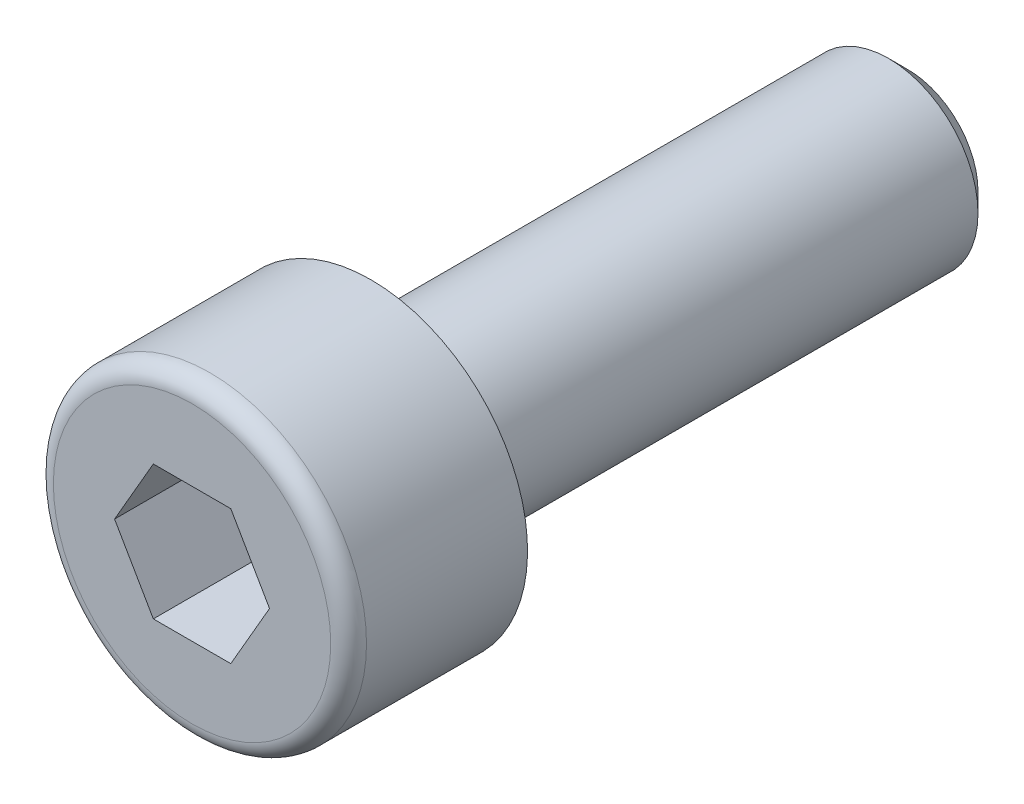
ISO-10303-21;
HEADER;
FILE_DESCRIPTION(('STEP AP214'),'2;1');
FILE_NAME('part.step','',(''),(''),'','','');
FILE_SCHEMA(('AUTOMOTIVE_DESIGN { 1 0 10303 214 1 1 1 1 }'));
ENDSEC;
DATA;
#1=APPLICATION_CONTEXT('core data for automotive mechanical design processes');
#2=APPLICATION_PROTOCOL_DEFINITION('international standard','automotive_design',2000,#1);
#3=PRODUCT_CONTEXT('',#1,'mechanical');
#4=PRODUCT('Part','Part','',(#3));
#5=PRODUCT_RELATED_PRODUCT_CATEGORY('part','',(#4));
#6=PRODUCT_DEFINITION_FORMATION('','',#4);
#7=PRODUCT_DEFINITION_CONTEXT('part definition',#1,'design');
#8=PRODUCT_DEFINITION('design','',#6,#7);
#9=PRODUCT_DEFINITION_SHAPE('','',#8);
#10=(LENGTH_UNIT() NAMED_UNIT(*) SI_UNIT(.MILLI.,.METRE.));
#11=(NAMED_UNIT(*) PLANE_ANGLE_UNIT() SI_UNIT($,.RADIAN.));
#12=(NAMED_UNIT(*) SI_UNIT($,.STERADIAN.) SOLID_ANGLE_UNIT());
#13=UNCERTAINTY_MEASURE_WITH_UNIT(LENGTH_MEASURE(1.E-05),#10,'distance_accuracy_value','');
#14=(GEOMETRIC_REPRESENTATION_CONTEXT(3) GLOBAL_UNCERTAINTY_ASSIGNED_CONTEXT((#13)) GLOBAL_UNIT_ASSIGNED_CONTEXT((#10,
#11,#12)) REPRESENTATION_CONTEXT('',''));
#15=CARTESIAN_POINT('',(0.,0.,0.));
#16=DIRECTION('',(0.,0.,1.));
#17=DIRECTION('',(1.,0.,0.));
#18=AXIS2_PLACEMENT_3D('',#15,#16,#17);
#19=CARTESIAN_POINT('',(0.,-1.5,2.50347876849692));
#20=DIRECTION('',(0.,1.,0.));
#21=DIRECTION('',(0.,0.,1.));
#22=AXIS2_PLACEMENT_3D('',#19,#20,#21);
#23=PLANE('',#22);
#24=DIRECTION('',(0.,0.,1.));
#25=VECTOR('',#24,1.);
#26=CARTESIAN_POINT('',(-0.866025403784438,-1.5,2.50347876849692));
#27=LINE('',#26,#25);
#28=CARTESIAN_POINT('',(-0.866025403784439,-1.5,4.));
#29=VERTEX_POINT('',#28);
#30=CARTESIAN_POINT('',(-0.866025403784439,-1.5,1.00695753699384));
#31=VERTEX_POINT('',#30);
#32=EDGE_CURVE('E73',#29,#31,#27,.F.);
#33=ORIENTED_EDGE('',*,*,#32,.F.);
#34=DIRECTION('',(1.,0.,0.));
#35=VECTOR('',#34,1.);
#36=CARTESIAN_POINT('',(0.,-1.5,4.));
#37=LINE('',#36,#35);
#38=CARTESIAN_POINT('',(0.866025403784439,-1.5,4.));
#39=VERTEX_POINT('',#38);
#40=EDGE_CURVE('E65',#29,#39,#37,.T.);
#41=ORIENTED_EDGE('',*,*,#40,.T.);
#42=DIRECTION('',(0.,0.,1.));
#43=VECTOR('',#42,1.);
#44=CARTESIAN_POINT('',(0.866025403784439,-1.5,2.50347876849692));
#45=LINE('',#44,#43);
#46=CARTESIAN_POINT('',(0.866025403784439,-1.5,1.00695753699384));
#47=VERTEX_POINT('',#46);
#48=EDGE_CURVE('E76',#47,#39,#45,.T.);
#49=ORIENTED_EDGE('',*,*,#48,.F.);
#50=DIRECTION('',(1.,0.,0.));
#51=VECTOR('',#50,1.);
#52=CARTESIAN_POINT('',(0.,-1.5,1.00695753699384));
#53=LINE('',#52,#51);
#54=EDGE_CURVE('E70',#47,#31,#53,.F.);
#55=ORIENTED_EDGE('',*,*,#54,.T.);
#56=EDGE_LOOP('',(#33,#41,#49,#55));
#57=FACE_BOUND('',#56,.T.);
#58=ADVANCED_FACE('F17',(#57),#23,.T.);
#59=CARTESIAN_POINT('',(-1.29903810567666,-0.750000000000001,2.50347876849692));
#60=DIRECTION('',(0.866025403784438,0.500000000000001,0.));
#61=DIRECTION('',(-0.500000000000001,0.866025403784438,0.));
#62=AXIS2_PLACEMENT_3D('',#59,#60,#61);
#63=PLANE('',#62);
#64=DIRECTION('',(0.,0.,1.));
#65=VECTOR('',#64,1.);
#66=CARTESIAN_POINT('',(-1.73205080756888,0.,2.50347876849692));
#67=LINE('',#66,#65);
#68=CARTESIAN_POINT('',(-1.73205080756888,0.,4.));
#69=VERTEX_POINT('',#68);
#70=CARTESIAN_POINT('',(-1.73205080756888,0.,1.00695753699384));
#71=VERTEX_POINT('',#70);
#72=EDGE_CURVE('E239',#69,#71,#67,.F.);
#73=ORIENTED_EDGE('',*,*,#72,.F.);
#74=DIRECTION('',(-0.500000000000001,0.866025403784438,0.));
#75=VECTOR('',#74,1.);
#76=CARTESIAN_POINT('',(-1.29903810567666,-0.750000000000001,4.));
#77=LINE('',#76,#75);
#78=EDGE_CURVE('E88',#69,#29,#77,.F.);
#79=ORIENTED_EDGE('',*,*,#78,.T.);
#80=ORIENTED_EDGE('',*,*,#32,.T.);
#81=DIRECTION('',(-0.500000000000001,0.866025403784438,0.));
#82=VECTOR('',#81,1.);
#83=CARTESIAN_POINT('',(-1.29903810567666,-0.750000000000001,1.00695753699384));
#84=LINE('',#83,#82);
#85=EDGE_CURVE('E81',#31,#71,#84,.T.);
#86=ORIENTED_EDGE('',*,*,#85,.T.);
#87=EDGE_LOOP('',(#73,#79,#80,#86));
#88=FACE_BOUND('',#87,.T.);
#89=ADVANCED_FACE('F90',(#88),#63,.T.);
#90=CARTESIAN_POINT('',(1.29903810567666,-0.749999999999999,2.50347876849692));
#91=DIRECTION('',(-0.866025403784439,0.5,0.));
#92=DIRECTION('',(-0.5,-0.866025403784439,0.));
#93=AXIS2_PLACEMENT_3D('',#90,#91,#92);
#94=PLANE('',#93);
#95=ORIENTED_EDGE('',*,*,#48,.T.);
#96=DIRECTION('',(-0.5,-0.866025403784439,0.));
#97=VECTOR('',#96,1.);
#98=CARTESIAN_POINT('',(1.29903810567666,-0.749999999999999,4.));
#99=LINE('',#98,#97);
#100=CARTESIAN_POINT('',(1.73205080756888,0.,4.));
#101=VERTEX_POINT('',#100);
#102=EDGE_CURVE('E241',#39,#101,#99,.F.);
#103=ORIENTED_EDGE('',*,*,#102,.T.);
#104=DIRECTION('',(0.,0.,1.));
#105=VECTOR('',#104,1.);
#106=CARTESIAN_POINT('',(1.73205080756888,0.,2.50347876849692));
#107=LINE('',#106,#105);
#108=CARTESIAN_POINT('',(1.73205080756888,0.,1.00695753699384));
#109=VERTEX_POINT('',#108);
#110=EDGE_CURVE('E229',#109,#101,#107,.T.);
#111=ORIENTED_EDGE('',*,*,#110,.F.);
#112=DIRECTION('',(-0.5,-0.866025403784439,0.));
#113=VECTOR('',#112,1.);
#114=CARTESIAN_POINT('',(1.73205080756888,0.,1.00695753699384));
#115=LINE('',#114,#113);
#116=EDGE_CURVE('E235',#109,#47,#115,.T.);
#117=ORIENTED_EDGE('',*,*,#116,.T.);
#118=EDGE_LOOP('',(#95,#103,#111,#117));
#119=FACE_BOUND('',#118,.T.);
#120=ADVANCED_FACE('F153',(#119),#94,.T.);
#121=CARTESIAN_POINT('',(-1.29903810567666,0.749999999999999,2.50347876849692));
#122=DIRECTION('',(0.866025403784439,-0.5,0.));
#123=DIRECTION('',(0.5,0.866025403784439,0.));
#124=AXIS2_PLACEMENT_3D('',#121,#122,#123);
#125=PLANE('',#124);
#126=DIRECTION('',(0.,0.,-1.));
#127=VECTOR('',#126,1.);
#128=CARTESIAN_POINT('',(-0.866025403784439,1.5,2.50347876849692));
#129=LINE('',#128,#127);
#130=CARTESIAN_POINT('',(-0.866025403784438,1.5,4.));
#131=VERTEX_POINT('',#130);
#132=CARTESIAN_POINT('',(-0.866025403784439,1.5,1.00695753699384));
#133=VERTEX_POINT('',#132);
#134=EDGE_CURVE('E224',#131,#133,#129,.T.);
#135=ORIENTED_EDGE('',*,*,#134,.F.);
#136=DIRECTION('',(0.5,0.866025403784439,0.));
#137=VECTOR('',#136,1.);
#138=CARTESIAN_POINT('',(-1.29903810567666,0.749999999999999,4.));
#139=LINE('',#138,#137);
#140=EDGE_CURVE('E35',#131,#69,#139,.F.);
#141=ORIENTED_EDGE('',*,*,#140,.T.);
#142=ORIENTED_EDGE('',*,*,#72,.T.);
#143=DIRECTION('',(0.499999999999999,0.866025403784439,0.));
#144=VECTOR('',#143,1.);
#145=CARTESIAN_POINT('',(-1.73205080756888,0.,1.00695753699384));
#146=LINE('',#145,#144);
#147=EDGE_CURVE('E84',#71,#133,#146,.T.);
#148=ORIENTED_EDGE('',*,*,#147,.T.);
#149=EDGE_LOOP('',(#135,#141,#142,#148));
#150=FACE_BOUND('',#149,.T.);
#151=ADVANCED_FACE('F150',(#150),#125,.T.);
#152=CARTESIAN_POINT('',(0.,0.,1.00695753699384));
#153=DIRECTION('',(0.,0.,-1.));
#154=DIRECTION('',(0.,1.,0.));
#155=AXIS2_PLACEMENT_3D('',#152,#153,#154);
#156=PLANE('',#155);
#157=DIRECTION('',(0.500000000000001,-0.866025403784438,0.));
#158=VECTOR('',#157,1.);
#159=CARTESIAN_POINT('',(1.29903810567666,0.750000000000001,1.00695753699384));
#160=LINE('',#159,#158);
#161=CARTESIAN_POINT('',(0.866025403784438,1.5,1.00695753699384));
#162=VERTEX_POINT('',#161);
#163=EDGE_CURVE('E232',#162,#109,#160,.T.);
#164=ORIENTED_EDGE('',*,*,#163,.F.);
#165=DIRECTION('',(1.,0.,0.));
#166=VECTOR('',#165,1.);
#167=CARTESIAN_POINT('',(0.,1.5,1.00695753699384));
#168=LINE('',#167,#166);
#169=EDGE_CURVE('E221',#133,#162,#168,.T.);
#170=ORIENTED_EDGE('',*,*,#169,.F.);
#171=ORIENTED_EDGE('',*,*,#147,.F.);
#172=ORIENTED_EDGE('',*,*,#85,.F.);
#173=ORIENTED_EDGE('',*,*,#54,.F.);
#174=ORIENTED_EDGE('',*,*,#116,.F.);
#175=EDGE_LOOP('',(#164,#170,#171,#172,#173,#174));
#176=FACE_BOUND('',#175,.T.);
#177=ADVANCED_FACE('F82',(#176),#156,.F.);
#178=CARTESIAN_POINT('',(1.29903810567666,0.750000000000001,2.50347876849692));
#179=DIRECTION('',(-0.866025403784438,-0.500000000000001,0.));
#180=DIRECTION('',(0.500000000000001,-0.866025403784438,0.));
#181=AXIS2_PLACEMENT_3D('',#178,#179,#180);
#182=PLANE('',#181);
#183=ORIENTED_EDGE('',*,*,#110,.T.);
#184=DIRECTION('',(0.500000000000001,-0.866025403784438,0.));
#185=VECTOR('',#184,1.);
#186=CARTESIAN_POINT('',(1.29903810567666,0.75,4.));
#187=LINE('',#186,#185);
#188=CARTESIAN_POINT('',(0.866025403784438,1.5,4.));
#189=VERTEX_POINT('',#188);
#190=EDGE_CURVE('E227',#101,#189,#187,.F.);
#191=ORIENTED_EDGE('',*,*,#190,.T.);
#192=DIRECTION('',(0.,0.,-1.));
#193=VECTOR('',#192,1.);
#194=CARTESIAN_POINT('',(0.866025403784439,1.5,2.50347876849692));
#195=LINE('',#194,#193);
#196=EDGE_CURVE('E213',#162,#189,#195,.F.);
#197=ORIENTED_EDGE('',*,*,#196,.F.);
#198=ORIENTED_EDGE('',*,*,#163,.T.);
#199=EDGE_LOOP('',(#183,#191,#197,#198));
#200=FACE_BOUND('',#199,.T.);
#201=ADVANCED_FACE('F143',(#200),#182,.T.);
#202=CARTESIAN_POINT('',(0.,1.5,2.50347876849692));
#203=DIRECTION('',(0.,-1.,0.));
#204=DIRECTION('',(0.,0.,-1.));
#205=AXIS2_PLACEMENT_3D('',#202,#203,#204);
#206=PLANE('',#205);
#207=ORIENTED_EDGE('',*,*,#196,.T.);
#208=DIRECTION('',(1.,0.,0.));
#209=VECTOR('',#208,1.);
#210=CARTESIAN_POINT('',(0.,1.5,4.));
#211=LINE('',#210,#209);
#212=EDGE_CURVE('E115',#131,#189,#211,.T.);
#213=ORIENTED_EDGE('',*,*,#212,.F.);
#214=ORIENTED_EDGE('',*,*,#134,.T.);
#215=ORIENTED_EDGE('',*,*,#169,.T.);
#216=EDGE_LOOP('',(#207,#213,#214,#215));
#217=FACE_BOUND('',#216,.T.);
#218=ADVANCED_FACE('F138',(#217),#206,.T.);
#219=CARTESIAN_POINT('',(0.,0.,4.));
#220=DIRECTION('',(0.,0.,1.));
#221=DIRECTION('',(0.,-1.,0.));
#222=AXIS2_PLACEMENT_3D('',#219,#220,#221);
#223=PLANE('',#222);
#224=CARTESIAN_POINT('',(0.,0.,4.));
#225=DIRECTION('',(0.,0.,-1.));
#226=DIRECTION('',(1.,0.,0.));
#227=AXIS2_PLACEMENT_3D('',#224,#225,#226);
#228=CIRCLE('',#227,3.1);
#229=CARTESIAN_POINT('',(3.1,0.,4.));
#230=VERTEX_POINT('',#229);
#231=EDGE_CURVE('E110',#230,#230,#228,.T.);
#232=ORIENTED_EDGE('',*,*,#231,.F.);
#233=EDGE_LOOP('',(#232));
#234=FACE_BOUND('',#233,.T.);
#235=ORIENTED_EDGE('',*,*,#140,.F.);
#236=ORIENTED_EDGE('',*,*,#212,.T.);
#237=ORIENTED_EDGE('',*,*,#190,.F.);
#238=ORIENTED_EDGE('',*,*,#102,.F.);
#239=ORIENTED_EDGE('',*,*,#40,.F.);
#240=ORIENTED_EDGE('',*,*,#78,.F.);
#241=EDGE_LOOP('',(#235,#236,#237,#238,#239,#240));
#242=FACE_BOUND('',#241,.T.);
#243=ADVANCED_FACE('F127',(#234,#242),#223,.T.);
#244=CARTESIAN_POINT('',(0.,0.,3.6));
#245=DIRECTION('',(0.,0.,-1.));
#246=DIRECTION('',(1.,0.,0.));
#247=AXIS2_PLACEMENT_3D('',#244,#245,#246);
#248=TOROIDAL_SURFACE('',#247,3.1,0.4);
#249=CARTESIAN_POINT('',(0.,0.,3.6));
#250=DIRECTION('',(0.,0.,-1.));
#251=DIRECTION('',(0.,1.,0.));
#252=AXIS2_PLACEMENT_3D('',#249,#250,#251);
#253=CIRCLE('',#252,3.5);
#254=CARTESIAN_POINT('',(0.,3.5,3.6));
#255=VERTEX_POINT('',#254);
#256=EDGE_CURVE('E106',#255,#255,#253,.T.);
#257=ORIENTED_EDGE('',*,*,#256,.F.);
#258=EDGE_LOOP('',(#257));
#259=FACE_BOUND('',#258,.T.);
#260=ORIENTED_EDGE('',*,*,#231,.T.);
#261=EDGE_LOOP('',(#260));
#262=FACE_BOUND('',#261,.T.);
#263=ADVANCED_FACE('F137',(#259,#262),#248,.T.);
#264=CARTESIAN_POINT('',(0.,0.,1.8));
#265=DIRECTION('',(0.,0.,-1.));
#266=DIRECTION('',(0.,1.,0.));
#267=AXIS2_PLACEMENT_3D('',#264,#265,#266);
#268=CYLINDRICAL_SURFACE('',#267,3.5);
#269=CARTESIAN_POINT('',(0.,0.,0.));
#270=DIRECTION('',(0.,0.,-1.));
#271=DIRECTION('',(0.,1.,0.));
#272=AXIS2_PLACEMENT_3D('',#269,#270,#271);
#273=CIRCLE('',#272,3.5);
#274=CARTESIAN_POINT('',(0.,3.5,0.));
#275=VERTEX_POINT('',#274);
#276=EDGE_CURVE('E20',#275,#275,#273,.T.);
#277=ORIENTED_EDGE('',*,*,#276,.F.);
#278=EDGE_LOOP('',(#277));
#279=FACE_BOUND('',#278,.T.);
#280=ORIENTED_EDGE('',*,*,#256,.T.);
#281=EDGE_LOOP('',(#280));
#282=FACE_BOUND('',#281,.T.);
#283=ADVANCED_FACE('F199',(#279,#282),#268,.T.);
#284=CARTESIAN_POINT('',(0.,0.,0.));
#285=DIRECTION('',(0.,0.,-1.));
#286=DIRECTION('',(0.,1.,0.));
#287=AXIS2_PLACEMENT_3D('',#284,#285,#286);
#288=PLANE('',#287);
#289=ORIENTED_EDGE('',*,*,#276,.T.);
#290=EDGE_LOOP('',(#289));
#291=FACE_BOUND('',#290,.T.);
#292=CARTESIAN_POINT('',(0.,0.,0.));
#293=DIRECTION('',(0.,0.,-1.));
#294=DIRECTION('',(1.,0.,0.));
#295=AXIS2_PLACEMENT_3D('',#292,#293,#294);
#296=CIRCLE('',#295,2.2);
#297=CARTESIAN_POINT('',(2.2,0.,0.));
#298=VERTEX_POINT('',#297);
#299=EDGE_CURVE('E96',#298,#298,#296,.F.);
#300=ORIENTED_EDGE('',*,*,#299,.T.);
#301=EDGE_LOOP('',(#300));
#302=FACE_BOUND('',#301,.T.);
#303=ADVANCED_FACE('F191',(#291,#302),#288,.T.);
#304=CARTESIAN_POINT('',(0.,0.,-12.));
#305=DIRECTION('',(0.,0.,1.));
#306=DIRECTION('',(0.,-1.,0.));
#307=AXIS2_PLACEMENT_3D('',#304,#305,#306);
#308=PLANE('',#307);
#309=CARTESIAN_POINT('',(0.,0.,-12.0000000000005));
#310=DIRECTION('',(0.,0.,1.));
#311=DIRECTION('',(1.,0.,0.));
#312=AXIS2_PLACEMENT_3D('',#309,#310,#311);
#313=CIRCLE('',#312,1.57059999997955);
#314=CARTESIAN_POINT('',(1.57059999997955,0.,-12.0000000000005));
#315=VERTEX_POINT('',#314);
#316=EDGE_CURVE('E94',#315,#315,#313,.T.);
#317=ORIENTED_EDGE('',*,*,#316,.F.);
#318=EDGE_LOOP('',(#317));
#319=FACE_BOUND('',#318,.T.);
#320=ADVANCED_FACE('F182',(#319),#308,.F.);
#321=CARTESIAN_POINT('',(0.,0.,-0.2));
#322=DIRECTION('',(0.,0.,-1.));
#323=DIRECTION('',(1.,0.,0.));
#324=AXIS2_PLACEMENT_3D('',#321,#322,#323);
#325=TOROIDAL_SURFACE('',#324,2.2,0.2);
#326=ORIENTED_EDGE('',*,*,#299,.F.);
#327=EDGE_LOOP('',(#326));
#328=FACE_BOUND('',#327,.T.);
#329=CARTESIAN_POINT('',(0.,0.,-0.2));
#330=DIRECTION('',(0.,0.,-1.));
#331=DIRECTION('',(0.,1.,0.));
#332=AXIS2_PLACEMENT_3D('',#329,#330,#331);
#333=CIRCLE('',#332,2.);
#334=CARTESIAN_POINT('',(0.,2.,-0.2));
#335=VERTEX_POINT('',#334);
#336=EDGE_CURVE('E26',#335,#335,#333,.T.);
#337=ORIENTED_EDGE('',*,*,#336,.F.);
#338=EDGE_LOOP('',(#337));
#339=FACE_BOUND('',#338,.T.);
#340=ADVANCED_FACE('F171',(#328,#339),#325,.F.);
#341=CARTESIAN_POINT('',(0.,0.,-11.5706000000841));
#342=DIRECTION('',(0.,0.,1.));
#343=DIRECTION('',(1.,0.,0.));
#344=AXIS2_PLACEMENT_3D('',#341,#342,#343);
#345=CONICAL_SURFACE('',#344,1.99999999989586,0.785398163397448);
#346=ORIENTED_EDGE('',*,*,#316,.T.);
#347=EDGE_LOOP('',(#346));
#348=FACE_BOUND('',#347,.T.);
#349=CARTESIAN_POINT('',(0.,0.,-11.5706));
#350=DIRECTION('',(0.,0.,-1.));
#351=DIRECTION('',(0.,1.,0.));
#352=AXIS2_PLACEMENT_3D('',#349,#350,#351);
#353=CIRCLE('',#352,2.);
#354=CARTESIAN_POINT('',(0.,2.,-11.5706));
#355=VERTEX_POINT('',#354);
#356=EDGE_CURVE('E11',#355,#355,#353,.F.);
#357=ORIENTED_EDGE('',*,*,#356,.F.);
#358=EDGE_LOOP('',(#357));
#359=FACE_BOUND('',#358,.T.);
#360=ADVANCED_FACE('F164',(#348,#359),#345,.T.);
#361=CARTESIAN_POINT('',(0.,0.,-5.7853));
#362=DIRECTION('',(0.,0.,-1.));
#363=DIRECTION('',(0.,1.,0.));
#364=AXIS2_PLACEMENT_3D('',#361,#362,#363);
#365=CYLINDRICAL_SURFACE('',#364,2.);
#366=ORIENTED_EDGE('',*,*,#336,.T.);
#367=EDGE_LOOP('',(#366));
#368=FACE_BOUND('',#367,.T.);
#369=ORIENTED_EDGE('',*,*,#356,.T.);
#370=EDGE_LOOP('',(#369));
#371=FACE_BOUND('',#370,.T.);
#372=ADVANCED_FACE('F162',(#368,#371),#365,.T.);
#373=CLOSED_SHELL('',(#58,#89,#120,#151,#177,#201,#218,#243,#263,#283,#303,#320,#340,#360,#372));
#374=CARTESIAN_POINT('',(0.,0.,0.));
#375=DIRECTION('',(0.,0.,-1.));
#376=DIRECTION('',(1.,0.,0.));
#377=AXIS2_PLACEMENT_3D('',#374,#375,#376);
#378=TOROIDAL_SURFACE('',#377,2.,0.04);
#379=ADVANCED_FACE('F175',(),#378,.F.);
#380=CLOSED_SHELL('',(#379));
#381=ORIENTED_CLOSED_SHELL('',*,#380,.T.);
#382=BREP_WITH_VOIDS('B1',#373,(#381));
#383=ADVANCED_BREP_SHAPE_REPRESENTATION('',(#18,#382),#14);
#384=SHAPE_DEFINITION_REPRESENTATION(#9,#383);
ENDSEC;
END-ISO-10303-21;
